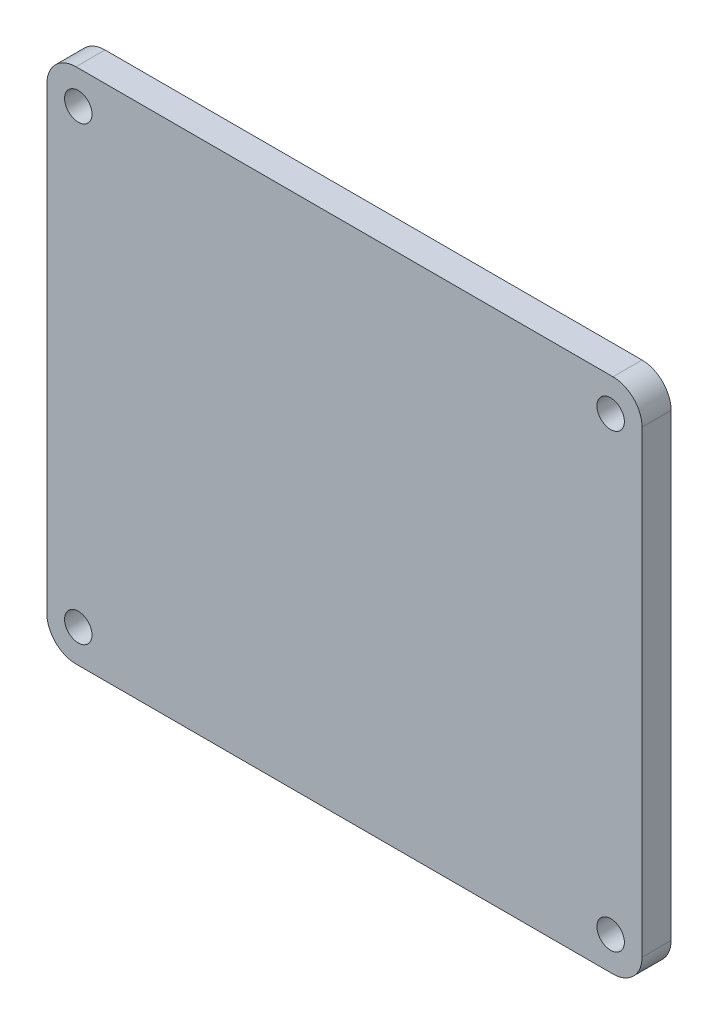
ISO-10303-21;
HEADER;
FILE_DESCRIPTION(('STEP AP214'),'2;1');
FILE_NAME('part.step','',(''),(''),'','','');
FILE_SCHEMA(('AUTOMOTIVE_DESIGN { 1 0 10303 214 1 1 1 1 }'));
ENDSEC;
DATA;
#1=APPLICATION_CONTEXT('core data for automotive mechanical design processes');
#2=APPLICATION_PROTOCOL_DEFINITION('international standard','automotive_design',2000,#1);
#3=PRODUCT_CONTEXT('',#1,'mechanical');
#4=PRODUCT('Part','Part','',(#3));
#5=PRODUCT_RELATED_PRODUCT_CATEGORY('part','',(#4));
#6=PRODUCT_DEFINITION_FORMATION('','',#4);
#7=PRODUCT_DEFINITION_CONTEXT('part definition',#1,'design');
#8=PRODUCT_DEFINITION('design','',#6,#7);
#9=PRODUCT_DEFINITION_SHAPE('','',#8);
#10=(LENGTH_UNIT() NAMED_UNIT(*) SI_UNIT(.MILLI.,.METRE.));
#11=(NAMED_UNIT(*) PLANE_ANGLE_UNIT() SI_UNIT($,.RADIAN.));
#12=(NAMED_UNIT(*) SI_UNIT($,.STERADIAN.) SOLID_ANGLE_UNIT());
#13=UNCERTAINTY_MEASURE_WITH_UNIT(LENGTH_MEASURE(1.E-05),#10,'distance_accuracy_value','');
#14=(GEOMETRIC_REPRESENTATION_CONTEXT(3) GLOBAL_UNCERTAINTY_ASSIGNED_CONTEXT((#13)) GLOBAL_UNIT_ASSIGNED_CONTEXT((#10,
#11,#12)) REPRESENTATION_CONTEXT('',''));
#15=CARTESIAN_POINT('',(0.,0.,0.));
#16=DIRECTION('',(0.,0.,1.));
#17=DIRECTION('',(1.,0.,0.));
#18=AXIS2_PLACEMENT_3D('',#15,#16,#17);
#19=CARTESIAN_POINT('',(-32.512,20.3199999999999,47.625));
#20=DIRECTION('',(-1.,0.,0.));
#21=DIRECTION('',(0.,0.,1.));
#22=AXIS2_PLACEMENT_3D('',#19,#20,#21);
#23=PLANE('',#22);
#24=DIRECTION('',(0.,-1.,0.));
#25=VECTOR('',#24,1.);
#26=CARTESIAN_POINT('',(-32.512,20.3199999999999,50.8));
#27=LINE('',#26,#25);
#28=CARTESIAN_POINT('',(-32.512,73.66,50.8));
#29=VERTEX_POINT('',#28);
#30=CARTESIAN_POINT('',(-32.512,23.4949999999999,50.8));
#31=VERTEX_POINT('',#30);
#32=EDGE_CURVE('E161',#29,#31,#27,.T.);
#33=ORIENTED_EDGE('',*,*,#32,.F.);
#34=DIRECTION('',(0.,0.,1.));
#35=VECTOR('',#34,1.);
#36=CARTESIAN_POINT('',(-32.512,73.66,47.625));
#37=LINE('',#36,#35);
#38=CARTESIAN_POINT('',(-32.512,73.66,47.625));
#39=VERTEX_POINT('',#38);
#40=EDGE_CURVE('E141',#29,#39,#37,.F.);
#41=ORIENTED_EDGE('',*,*,#40,.T.);
#42=DIRECTION('',(0.,-1.,0.));
#43=VECTOR('',#42,1.);
#44=CARTESIAN_POINT('',(-32.512,20.3199999999999,47.625));
#45=LINE('',#44,#43);
#46=CARTESIAN_POINT('',(-32.512,23.4949999999999,47.625));
#47=VERTEX_POINT('',#46);
#48=EDGE_CURVE('E122',#39,#47,#45,.T.);
#49=ORIENTED_EDGE('',*,*,#48,.T.);
#50=DIRECTION('',(0.,0.,1.));
#51=VECTOR('',#50,1.);
#52=CARTESIAN_POINT('',(-32.512,23.4949999999999,47.625));
#53=LINE('',#52,#51);
#54=EDGE_CURVE('E138',#47,#31,#53,.T.);
#55=ORIENTED_EDGE('',*,*,#54,.T.);
#56=EDGE_LOOP('',(#33,#41,#49,#55));
#57=FACE_BOUND('',#56,.T.);
#58=ADVANCED_FACE('F36',(#57),#23,.T.);
#59=CARTESIAN_POINT('',(-32.512,76.835,47.625));
#60=DIRECTION('',(0.,1.,0.));
#61=DIRECTION('',(-1.,0.,0.));
#62=AXIS2_PLACEMENT_3D('',#59,#60,#61);
#63=PLANE('',#62);
#64=DIRECTION('',(-1.,0.,0.));
#65=VECTOR('',#64,1.);
#66=CARTESIAN_POINT('',(-32.512,76.835,47.625));
#67=LINE('',#66,#65);
#68=CARTESIAN_POINT('',(29.337,76.835,47.625));
#69=VERTEX_POINT('',#68);
#70=CARTESIAN_POINT('',(-29.337,76.835,47.625));
#71=VERTEX_POINT('',#70);
#72=EDGE_CURVE('E126',#69,#71,#67,.T.);
#73=ORIENTED_EDGE('',*,*,#72,.T.);
#74=DIRECTION('',(0.,0.,1.));
#75=VECTOR('',#74,1.);
#76=CARTESIAN_POINT('',(-29.337,76.835,47.625));
#77=LINE('',#76,#75);
#78=CARTESIAN_POINT('',(-29.337,76.835,50.8));
#79=VERTEX_POINT('',#78);
#80=EDGE_CURVE('E113',#71,#79,#77,.T.);
#81=ORIENTED_EDGE('',*,*,#80,.T.);
#82=DIRECTION('',(-1.,0.,0.));
#83=VECTOR('',#82,1.);
#84=CARTESIAN_POINT('',(-32.512,76.835,50.8));
#85=LINE('',#84,#83);
#86=CARTESIAN_POINT('',(29.337,76.835,50.8));
#87=VERTEX_POINT('',#86);
#88=EDGE_CURVE('E105',#87,#79,#85,.T.);
#89=ORIENTED_EDGE('',*,*,#88,.F.);
#90=DIRECTION('',(0.,0.,1.));
#91=VECTOR('',#90,1.);
#92=CARTESIAN_POINT('',(29.337,76.835,47.625));
#93=LINE('',#92,#91);
#94=EDGE_CURVE('E119',#87,#69,#93,.F.);
#95=ORIENTED_EDGE('',*,*,#94,.T.);
#96=EDGE_LOOP('',(#73,#81,#89,#95));
#97=FACE_BOUND('',#96,.T.);
#98=ADVANCED_FACE('F118',(#97),#63,.T.);
#99=CARTESIAN_POINT('',(32.512,20.32,47.625));
#100=DIRECTION('',(1.,0.,0.));
#101=DIRECTION('',(0.,1.,0.));
#102=AXIS2_PLACEMENT_3D('',#99,#100,#101);
#103=PLANE('',#102);
#104=DIRECTION('',(0.,1.,0.));
#105=VECTOR('',#104,1.);
#106=CARTESIAN_POINT('',(32.512,20.32,50.8));
#107=LINE('',#106,#105);
#108=CARTESIAN_POINT('',(32.512,23.495,50.8));
#109=VERTEX_POINT('',#108);
#110=CARTESIAN_POINT('',(32.512,73.66,50.8));
#111=VERTEX_POINT('',#110);
#112=EDGE_CURVE('E107',#109,#111,#107,.T.);
#113=ORIENTED_EDGE('',*,*,#112,.F.);
#114=DIRECTION('',(0.,0.,1.));
#115=VECTOR('',#114,1.);
#116=CARTESIAN_POINT('',(32.512,23.495,47.625));
#117=LINE('',#116,#115);
#118=CARTESIAN_POINT('',(32.512,23.495,47.625));
#119=VERTEX_POINT('',#118);
#120=EDGE_CURVE('E11',#109,#119,#117,.F.);
#121=ORIENTED_EDGE('',*,*,#120,.T.);
#122=DIRECTION('',(0.,1.,0.));
#123=VECTOR('',#122,1.);
#124=CARTESIAN_POINT('',(32.512,20.32,47.625));
#125=LINE('',#124,#123);
#126=CARTESIAN_POINT('',(32.512,73.66,47.625));
#127=VERTEX_POINT('',#126);
#128=EDGE_CURVE('E129',#119,#127,#125,.T.);
#129=ORIENTED_EDGE('',*,*,#128,.T.);
#130=DIRECTION('',(0.,0.,1.));
#131=VECTOR('',#130,1.);
#132=CARTESIAN_POINT('',(32.512,73.66,47.625));
#133=LINE('',#132,#131);
#134=EDGE_CURVE('E44',#127,#111,#133,.T.);
#135=ORIENTED_EDGE('',*,*,#134,.T.);
#136=EDGE_LOOP('',(#113,#121,#129,#135));
#137=FACE_BOUND('',#136,.T.);
#138=ADVANCED_FACE('F154',(#137),#103,.T.);
#139=CARTESIAN_POINT('',(32.512,20.32,47.625));
#140=DIRECTION('',(0.,-1.,0.));
#141=DIRECTION('',(1.,0.,0.));
#142=AXIS2_PLACEMENT_3D('',#139,#140,#141);
#143=PLANE('',#142);
#144=DIRECTION('',(1.,0.,0.));
#145=VECTOR('',#144,1.);
#146=CARTESIAN_POINT('',(32.512,20.32,50.8));
#147=LINE('',#146,#145);
#148=CARTESIAN_POINT('',(-29.337,20.3199999999999,50.8));
#149=VERTEX_POINT('',#148);
#150=CARTESIAN_POINT('',(29.337,20.32,50.8));
#151=VERTEX_POINT('',#150);
#152=EDGE_CURVE('E164',#149,#151,#147,.T.);
#153=ORIENTED_EDGE('',*,*,#152,.F.);
#154=DIRECTION('',(0.,0.,1.));
#155=VECTOR('',#154,1.);
#156=CARTESIAN_POINT('',(-29.337,20.3199999999999,47.625));
#157=LINE('',#156,#155);
#158=CARTESIAN_POINT('',(-29.337,20.3199999999999,47.625));
#159=VERTEX_POINT('',#158);
#160=EDGE_CURVE('E58',#149,#159,#157,.F.);
#161=ORIENTED_EDGE('',*,*,#160,.T.);
#162=DIRECTION('',(1.,0.,0.));
#163=VECTOR('',#162,1.);
#164=CARTESIAN_POINT('',(32.512,20.32,47.625));
#165=LINE('',#164,#163);
#166=CARTESIAN_POINT('',(29.337,20.32,47.625));
#167=VERTEX_POINT('',#166);
#168=EDGE_CURVE('E156',#159,#167,#165,.T.);
#169=ORIENTED_EDGE('',*,*,#168,.T.);
#170=DIRECTION('',(0.,0.,1.));
#171=VECTOR('',#170,1.);
#172=CARTESIAN_POINT('',(29.337,20.32,47.625));
#173=LINE('',#172,#171);
#174=EDGE_CURVE('E149',#167,#151,#173,.T.);
#175=ORIENTED_EDGE('',*,*,#174,.T.);
#176=EDGE_LOOP('',(#153,#161,#169,#175));
#177=FACE_BOUND('',#176,.T.);
#178=ADVANCED_FACE('F167',(#177),#143,.T.);
#179=CARTESIAN_POINT('',(0.,0.,47.625));
#180=DIRECTION('',(0.,0.,-1.));
#181=DIRECTION('',(-1.,0.,0.));
#182=AXIS2_PLACEMENT_3D('',#179,#180,#181);
#183=PLANE('',#182);
#184=CARTESIAN_POINT('',(29.083,73.2155,47.625));
#185=DIRECTION('',(0.,0.,-1.));
#186=DIRECTION('',(-1.,0.,0.));
#187=AXIS2_PLACEMENT_3D('',#184,#185,#186);
#188=CIRCLE('',#187,1.5);
#189=CARTESIAN_POINT('',(27.583,73.2155,47.625));
#190=VERTEX_POINT('',#189);
#191=EDGE_CURVE('E198',#190,#190,#188,.T.);
#192=ORIENTED_EDGE('',*,*,#191,.F.);
#193=EDGE_LOOP('',(#192));
#194=FACE_BOUND('',#193,.T.);
#195=CARTESIAN_POINT('',(29.083,23.9395,47.625));
#196=DIRECTION('',(0.,0.,-1.));
#197=DIRECTION('',(-1.,0.,0.));
#198=AXIS2_PLACEMENT_3D('',#195,#196,#197);
#199=CIRCLE('',#198,1.5);
#200=CARTESIAN_POINT('',(27.583,23.9395,47.625));
#201=VERTEX_POINT('',#200);
#202=EDGE_CURVE('E192',#201,#201,#199,.T.);
#203=ORIENTED_EDGE('',*,*,#202,.F.);
#204=EDGE_LOOP('',(#203));
#205=FACE_BOUND('',#204,.T.);
#206=CARTESIAN_POINT('',(-29.083,23.9395,47.625));
#207=DIRECTION('',(0.,0.,-1.));
#208=DIRECTION('',(-1.,0.,0.));
#209=AXIS2_PLACEMENT_3D('',#206,#207,#208);
#210=CIRCLE('',#209,1.5);
#211=CARTESIAN_POINT('',(-30.583,23.9395,47.625));
#212=VERTEX_POINT('',#211);
#213=EDGE_CURVE('E186',#212,#212,#210,.T.);
#214=ORIENTED_EDGE('',*,*,#213,.F.);
#215=EDGE_LOOP('',(#214));
#216=FACE_BOUND('',#215,.T.);
#217=CARTESIAN_POINT('',(-29.083,73.2155,47.625));
#218=DIRECTION('',(0.,0.,-1.));
#219=DIRECTION('',(-1.,0.,0.));
#220=AXIS2_PLACEMENT_3D('',#217,#218,#219);
#221=CIRCLE('',#220,1.5);
#222=CARTESIAN_POINT('',(-30.583,73.2155,47.625));
#223=VERTEX_POINT('',#222);
#224=EDGE_CURVE('E165',#223,#223,#221,.T.);
#225=ORIENTED_EDGE('',*,*,#224,.F.);
#226=EDGE_LOOP('',(#225));
#227=FACE_BOUND('',#226,.T.);
#228=ORIENTED_EDGE('',*,*,#48,.F.);
#229=CARTESIAN_POINT('',(-29.337,73.66,47.625));
#230=DIRECTION('',(0.,0.,-1.));
#231=DIRECTION('',(-1.,0.,0.));
#232=AXIS2_PLACEMENT_3D('',#229,#230,#231);
#233=CIRCLE('',#232,3.175);
#234=EDGE_CURVE('E147',#39,#71,#233,.T.);
#235=ORIENTED_EDGE('',*,*,#234,.T.);
#236=ORIENTED_EDGE('',*,*,#72,.F.);
#237=CARTESIAN_POINT('',(29.337,73.66,47.625));
#238=DIRECTION('',(0.,0.,-1.));
#239=DIRECTION('',(-1.,0.,0.));
#240=AXIS2_PLACEMENT_3D('',#237,#238,#239);
#241=CIRCLE('',#240,3.175);
#242=EDGE_CURVE('E125',#69,#127,#241,.T.);
#243=ORIENTED_EDGE('',*,*,#242,.T.);
#244=ORIENTED_EDGE('',*,*,#128,.F.);
#245=CARTESIAN_POINT('',(29.337,23.495,47.625));
#246=DIRECTION('',(0.,0.,-1.));
#247=DIRECTION('',(-1.,0.,0.));
#248=AXIS2_PLACEMENT_3D('',#245,#246,#247);
#249=CIRCLE('',#248,3.175);
#250=EDGE_CURVE('E51',#119,#167,#249,.T.);
#251=ORIENTED_EDGE('',*,*,#250,.T.);
#252=ORIENTED_EDGE('',*,*,#168,.F.);
#253=CARTESIAN_POINT('',(-29.337,23.4949999999999,47.625));
#254=DIRECTION('',(0.,0.,-1.));
#255=DIRECTION('',(-1.,0.,0.));
#256=AXIS2_PLACEMENT_3D('',#253,#254,#255);
#257=CIRCLE('',#256,3.175);
#258=EDGE_CURVE('E145',#159,#47,#257,.T.);
#259=ORIENTED_EDGE('',*,*,#258,.T.);
#260=EDGE_LOOP('',(#228,#235,#236,#243,#244,#251,#252,#259));
#261=FACE_BOUND('',#260,.T.);
#262=ADVANCED_FACE('F175',(#194,#205,#216,#227,#261),#183,.T.);
#263=CARTESIAN_POINT('',(0.,0.,50.8));
#264=DIRECTION('',(0.,0.,-1.));
#265=DIRECTION('',(-1.,0.,0.));
#266=AXIS2_PLACEMENT_3D('',#263,#264,#265);
#267=PLANE('',#266);
#268=CARTESIAN_POINT('',(29.083,73.2155,50.8));
#269=DIRECTION('',(0.,0.,1.));
#270=DIRECTION('',(1.,0.,0.));
#271=AXIS2_PLACEMENT_3D('',#268,#269,#270);
#272=CIRCLE('',#271,1.5);
#273=CARTESIAN_POINT('',(30.583,73.2155,50.8));
#274=VERTEX_POINT('',#273);
#275=EDGE_CURVE('E201',#274,#274,#272,.T.);
#276=ORIENTED_EDGE('',*,*,#275,.F.);
#277=EDGE_LOOP('',(#276));
#278=FACE_BOUND('',#277,.T.);
#279=CARTESIAN_POINT('',(29.083,23.9395,50.8));
#280=DIRECTION('',(0.,0.,1.));
#281=DIRECTION('',(1.,0.,0.));
#282=AXIS2_PLACEMENT_3D('',#279,#280,#281);
#283=CIRCLE('',#282,1.5);
#284=CARTESIAN_POINT('',(30.583,23.9395,50.8));
#285=VERTEX_POINT('',#284);
#286=EDGE_CURVE('E195',#285,#285,#283,.T.);
#287=ORIENTED_EDGE('',*,*,#286,.F.);
#288=EDGE_LOOP('',(#287));
#289=FACE_BOUND('',#288,.T.);
#290=CARTESIAN_POINT('',(-29.083,23.9395,50.8));
#291=DIRECTION('',(0.,0.,1.));
#292=DIRECTION('',(1.,0.,0.));
#293=AXIS2_PLACEMENT_3D('',#290,#291,#292);
#294=CIRCLE('',#293,1.5);
#295=CARTESIAN_POINT('',(-27.583,23.9395,50.8));
#296=VERTEX_POINT('',#295);
#297=EDGE_CURVE('E189',#296,#296,#294,.T.);
#298=ORIENTED_EDGE('',*,*,#297,.F.);
#299=EDGE_LOOP('',(#298));
#300=FACE_BOUND('',#299,.T.);
#301=CARTESIAN_POINT('',(-29.083,73.2155,50.8));
#302=DIRECTION('',(0.,0.,1.));
#303=DIRECTION('',(1.,0.,0.));
#304=AXIS2_PLACEMENT_3D('',#301,#302,#303);
#305=CIRCLE('',#304,1.5);
#306=CARTESIAN_POINT('',(-27.583,73.2155,50.8));
#307=VERTEX_POINT('',#306);
#308=EDGE_CURVE('E183',#307,#307,#305,.T.);
#309=ORIENTED_EDGE('',*,*,#308,.F.);
#310=EDGE_LOOP('',(#309));
#311=FACE_BOUND('',#310,.T.);
#312=ORIENTED_EDGE('',*,*,#88,.T.);
#313=CARTESIAN_POINT('',(-29.337,73.66,50.8));
#314=DIRECTION('',(0.,0.,-1.));
#315=DIRECTION('',(-1.,0.,0.));
#316=AXIS2_PLACEMENT_3D('',#313,#314,#315);
#317=CIRCLE('',#316,3.175);
#318=EDGE_CURVE('E136',#79,#29,#317,.F.);
#319=ORIENTED_EDGE('',*,*,#318,.T.);
#320=ORIENTED_EDGE('',*,*,#32,.T.);
#321=CARTESIAN_POINT('',(-29.337,23.4949999999999,50.8));
#322=DIRECTION('',(0.,0.,-1.));
#323=DIRECTION('',(-1.,0.,0.));
#324=AXIS2_PLACEMENT_3D('',#321,#322,#323);
#325=CIRCLE('',#324,3.175);
#326=EDGE_CURVE('E134',#31,#149,#325,.F.);
#327=ORIENTED_EDGE('',*,*,#326,.T.);
#328=ORIENTED_EDGE('',*,*,#152,.T.);
#329=CARTESIAN_POINT('',(29.337,23.495,50.8));
#330=DIRECTION('',(0.,0.,-1.));
#331=DIRECTION('',(-1.,0.,0.));
#332=AXIS2_PLACEMENT_3D('',#329,#330,#331);
#333=CIRCLE('',#332,3.175);
#334=EDGE_CURVE('E112',#151,#109,#333,.F.);
#335=ORIENTED_EDGE('',*,*,#334,.T.);
#336=ORIENTED_EDGE('',*,*,#112,.T.);
#337=CARTESIAN_POINT('',(29.337,73.66,50.8));
#338=DIRECTION('',(0.,0.,-1.));
#339=DIRECTION('',(-1.,0.,0.));
#340=AXIS2_PLACEMENT_3D('',#337,#338,#339);
#341=CIRCLE('',#340,3.175);
#342=EDGE_CURVE('E102',#111,#87,#341,.F.);
#343=ORIENTED_EDGE('',*,*,#342,.T.);
#344=EDGE_LOOP('',(#312,#319,#320,#327,#328,#335,#336,#343));
#345=FACE_BOUND('',#344,.T.);
#346=ADVANCED_FACE('F104',(#278,#289,#300,#311,#345),#267,.F.);
#347=CARTESIAN_POINT('',(-29.083,73.2155,50.8));
#348=DIRECTION('',(0.,0.,1.));
#349=DIRECTION('',(1.,0.,0.));
#350=AXIS2_PLACEMENT_3D('',#347,#348,#349);
#351=CYLINDRICAL_SURFACE('',#350,1.5);
#352=ORIENTED_EDGE('',*,*,#308,.T.);
#353=EDGE_LOOP('',(#352));
#354=FACE_BOUND('',#353,.T.);
#355=ORIENTED_EDGE('',*,*,#224,.T.);
#356=EDGE_LOOP('',(#355));
#357=FACE_BOUND('',#356,.T.);
#358=ADVANCED_FACE('F210',(#354,#357),#351,.F.);
#359=CARTESIAN_POINT('',(-29.083,23.9395,50.8));
#360=DIRECTION('',(0.,0.,1.));
#361=DIRECTION('',(1.,0.,0.));
#362=AXIS2_PLACEMENT_3D('',#359,#360,#361);
#363=CYLINDRICAL_SURFACE('',#362,1.5);
#364=ORIENTED_EDGE('',*,*,#297,.T.);
#365=EDGE_LOOP('',(#364));
#366=FACE_BOUND('',#365,.T.);
#367=ORIENTED_EDGE('',*,*,#213,.T.);
#368=EDGE_LOOP('',(#367));
#369=FACE_BOUND('',#368,.T.);
#370=ADVANCED_FACE('F220',(#366,#369),#363,.F.);
#371=CARTESIAN_POINT('',(29.083,23.9395,50.8));
#372=DIRECTION('',(0.,0.,1.));
#373=DIRECTION('',(1.,0.,0.));
#374=AXIS2_PLACEMENT_3D('',#371,#372,#373);
#375=CYLINDRICAL_SURFACE('',#374,1.5);
#376=ORIENTED_EDGE('',*,*,#286,.T.);
#377=EDGE_LOOP('',(#376));
#378=FACE_BOUND('',#377,.T.);
#379=ORIENTED_EDGE('',*,*,#202,.T.);
#380=EDGE_LOOP('',(#379));
#381=FACE_BOUND('',#380,.T.);
#382=ADVANCED_FACE('F279',(#378,#381),#375,.F.);
#383=CARTESIAN_POINT('',(29.083,73.2155,50.8));
#384=DIRECTION('',(0.,0.,1.));
#385=DIRECTION('',(1.,0.,0.));
#386=AXIS2_PLACEMENT_3D('',#383,#384,#385);
#387=CYLINDRICAL_SURFACE('',#386,1.5);
#388=ORIENTED_EDGE('',*,*,#275,.T.);
#389=EDGE_LOOP('',(#388));
#390=FACE_BOUND('',#389,.T.);
#391=ORIENTED_EDGE('',*,*,#191,.T.);
#392=EDGE_LOOP('',(#391));
#393=FACE_BOUND('',#392,.T.);
#394=ADVANCED_FACE('F205',(#390,#393),#387,.F.);
#395=CARTESIAN_POINT('',(-29.337,73.66,47.625));
#396=DIRECTION('',(0.,0.,1.));
#397=DIRECTION('',(1.,0.,0.));
#398=AXIS2_PLACEMENT_3D('',#395,#396,#397);
#399=CYLINDRICAL_SURFACE('',#398,3.175);
#400=ORIENTED_EDGE('',*,*,#234,.F.);
#401=ORIENTED_EDGE('',*,*,#40,.F.);
#402=ORIENTED_EDGE('',*,*,#318,.F.);
#403=ORIENTED_EDGE('',*,*,#80,.F.);
#404=EDGE_LOOP('',(#400,#401,#402,#403));
#405=FACE_BOUND('',#404,.T.);
#406=ADVANCED_FACE('F241',(#405),#399,.T.);
#407=CARTESIAN_POINT('',(-29.337,23.4949999999999,47.625));
#408=DIRECTION('',(0.,0.,1.));
#409=DIRECTION('',(1.,0.,0.));
#410=AXIS2_PLACEMENT_3D('',#407,#408,#409);
#411=CYLINDRICAL_SURFACE('',#410,3.175);
#412=ORIENTED_EDGE('',*,*,#258,.F.);
#413=ORIENTED_EDGE('',*,*,#160,.F.);
#414=ORIENTED_EDGE('',*,*,#326,.F.);
#415=ORIENTED_EDGE('',*,*,#54,.F.);
#416=EDGE_LOOP('',(#412,#413,#414,#415));
#417=FACE_BOUND('',#416,.T.);
#418=ADVANCED_FACE('F171',(#417),#411,.T.);
#419=CARTESIAN_POINT('',(29.337,23.495,47.625));
#420=DIRECTION('',(0.,0.,1.));
#421=DIRECTION('',(1.,0.,0.));
#422=AXIS2_PLACEMENT_3D('',#419,#420,#421);
#423=CYLINDRICAL_SURFACE('',#422,3.175);
#424=ORIENTED_EDGE('',*,*,#250,.F.);
#425=ORIENTED_EDGE('',*,*,#120,.F.);
#426=ORIENTED_EDGE('',*,*,#334,.F.);
#427=ORIENTED_EDGE('',*,*,#174,.F.);
#428=EDGE_LOOP('',(#424,#425,#426,#427));
#429=FACE_BOUND('',#428,.T.);
#430=ADVANCED_FACE('F246',(#429),#423,.T.);
#431=CARTESIAN_POINT('',(29.337,73.66,47.625));
#432=DIRECTION('',(0.,0.,1.));
#433=DIRECTION('',(1.,0.,0.));
#434=AXIS2_PLACEMENT_3D('',#431,#432,#433);
#435=CYLINDRICAL_SURFACE('',#434,3.175);
#436=ORIENTED_EDGE('',*,*,#242,.F.);
#437=ORIENTED_EDGE('',*,*,#94,.F.);
#438=ORIENTED_EDGE('',*,*,#342,.F.);
#439=ORIENTED_EDGE('',*,*,#134,.F.);
#440=EDGE_LOOP('',(#436,#437,#438,#439));
#441=FACE_BOUND('',#440,.T.);
#442=ADVANCED_FACE('F38',(#441),#435,.T.);
#443=CLOSED_SHELL('',(#58,#98,#138,#178,#262,#346,#358,#370,#382,#394,#406,#418,#430,#442));
#444=MANIFOLD_SOLID_BREP('B2',#443);
#445=ADVANCED_BREP_SHAPE_REPRESENTATION('',(#18,#444),#14);
#446=SHAPE_DEFINITION_REPRESENTATION(#9,#445);
ENDSEC;
END-ISO-10303-21;
